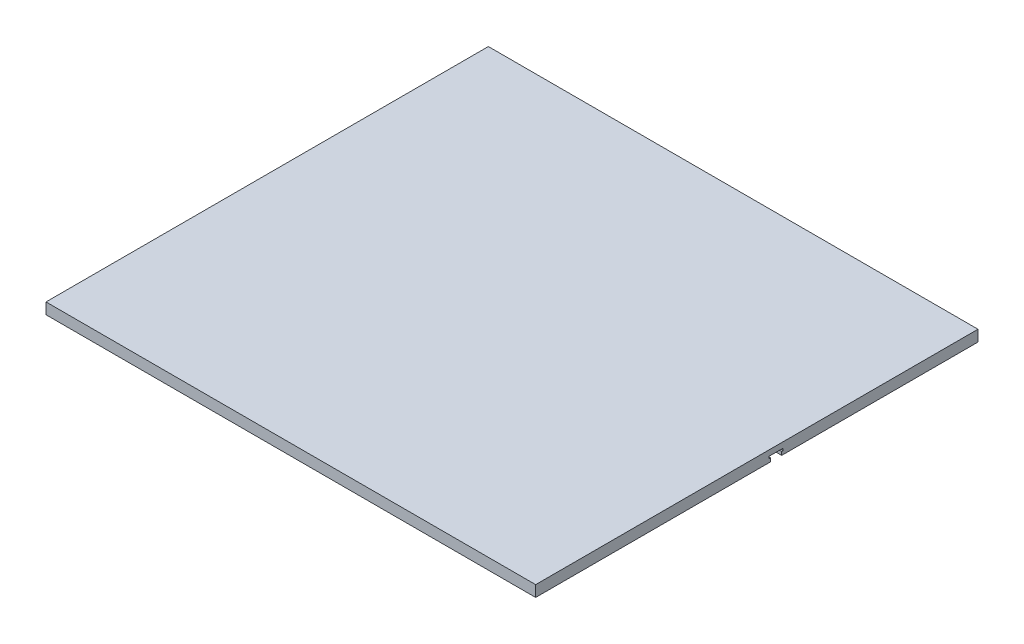
ISO-10303-21;
HEADER;
FILE_DESCRIPTION(('STEP AP214'),'2;1');
FILE_NAME('part.step','',(''),(''),'','','');
FILE_SCHEMA(('AUTOMOTIVE_DESIGN { 1 0 10303 214 1 1 1 1 }'));
ENDSEC;
DATA;
#1=APPLICATION_CONTEXT('core data for automotive mechanical design processes');
#2=APPLICATION_PROTOCOL_DEFINITION('international standard','automotive_design',2000,#1);
#3=PRODUCT_CONTEXT('',#1,'mechanical');
#4=PRODUCT('Part','Part','',(#3));
#5=PRODUCT_RELATED_PRODUCT_CATEGORY('part','',(#4));
#6=PRODUCT_DEFINITION_FORMATION('','',#4);
#7=PRODUCT_DEFINITION_CONTEXT('part definition',#1,'design');
#8=PRODUCT_DEFINITION('design','',#6,#7);
#9=PRODUCT_DEFINITION_SHAPE('','',#8);
#10=(LENGTH_UNIT() NAMED_UNIT(*) SI_UNIT(.MILLI.,.METRE.));
#11=(NAMED_UNIT(*) PLANE_ANGLE_UNIT() SI_UNIT($,.RADIAN.));
#12=(NAMED_UNIT(*) SI_UNIT($,.STERADIAN.) SOLID_ANGLE_UNIT());
#13=UNCERTAINTY_MEASURE_WITH_UNIT(LENGTH_MEASURE(1.E-05),#10,'distance_accuracy_value','');
#14=(GEOMETRIC_REPRESENTATION_CONTEXT(3) GLOBAL_UNCERTAINTY_ASSIGNED_CONTEXT((#13)) GLOBAL_UNIT_ASSIGNED_CONTEXT((#10,
#11,#12)) REPRESENTATION_CONTEXT('',''));
#15=CARTESIAN_POINT('',(0.,0.,0.));
#16=DIRECTION('',(0.,0.,1.));
#17=DIRECTION('',(1.,0.,0.));
#18=AXIS2_PLACEMENT_3D('',#15,#16,#17);
#19=CARTESIAN_POINT('',(0.,0.,0.));
#20=DIRECTION('',(0.,-1.,0.));
#21=DIRECTION('',(0.,0.,-1.));
#22=AXIS2_PLACEMENT_3D('',#19,#20,#21);
#23=PLANE('',#22);
#24=DIRECTION('',(1.,0.,0.));
#25=VECTOR('',#24,1.);
#26=CARTESIAN_POINT('',(0.,0.,-421.176450000013));
#27=LINE('',#26,#25);
#28=CARTESIAN_POINT('',(0.,0.,-421.176450000013));
#29=VERTEX_POINT('',#28);
#30=CARTESIAN_POINT('',(838.2,0.,-421.176450000013));
#31=VERTEX_POINT('',#30);
#32=EDGE_CURVE('E204',#29,#31,#27,.T.);
#33=ORIENTED_EDGE('',*,*,#32,.F.);
#34=DIRECTION('',(0.,0.,1.));
#35=VECTOR('',#34,1.);
#36=CARTESIAN_POINT('',(0.,0.,0.));
#37=LINE('',#36,#35);
#38=CARTESIAN_POINT('',(0.,0.,-757.2375));
#39=VERTEX_POINT('',#38);
#40=EDGE_CURVE('E214',#39,#29,#37,.T.);
#41=ORIENTED_EDGE('',*,*,#40,.F.);
#42=DIRECTION('',(-1.,0.,0.));
#43=VECTOR('',#42,1.);
#44=CARTESIAN_POINT('',(0.,0.,-757.2375));
#45=LINE('',#44,#43);
#46=CARTESIAN_POINT('',(838.2,0.,-757.2375));
#47=VERTEX_POINT('',#46);
#48=EDGE_CURVE('E89',#47,#39,#45,.T.);
#49=ORIENTED_EDGE('',*,*,#48,.F.);
#50=DIRECTION('',(0.,0.,-1.));
#51=VECTOR('',#50,1.);
#52=CARTESIAN_POINT('',(838.2,0.,0.));
#53=LINE('',#52,#51);
#54=EDGE_CURVE('E218',#31,#47,#53,.T.);
#55=ORIENTED_EDGE('',*,*,#54,.F.);
#56=EDGE_LOOP('',(#33,#41,#49,#55));
#57=FACE_BOUND('',#56,.T.);
#58=ADVANCED_FACE('F44',(#57),#23,.T.);
#59=CARTESIAN_POINT('',(0.,19.05,0.));
#60=DIRECTION('',(1.,0.,0.));
#61=DIRECTION('',(0.,0.,-1.));
#62=AXIS2_PLACEMENT_3D('',#59,#60,#61);
#63=PLANE('',#62);
#64=ORIENTED_EDGE('',*,*,#40,.T.);
#65=DIRECTION('',(0.,1.,0.));
#66=VECTOR('',#65,1.);
#67=CARTESIAN_POINT('',(0.,0.,-421.176450000013));
#68=LINE('',#67,#66);
#69=CARTESIAN_POINT('',(0.,5.96265000000044,-421.176450000013));
#70=VERTEX_POINT('',#69);
#71=EDGE_CURVE('E158',#29,#70,#68,.T.);
#72=ORIENTED_EDGE('',*,*,#71,.T.);
#73=DIRECTION('',(0.,0.,-1.));
#74=VECTOR('',#73,1.);
#75=CARTESIAN_POINT('',(0.,5.96265000000044,-421.176450000013));
#76=LINE('',#75,#74);
#77=CARTESIAN_POINT('',(0.,5.96265000000044,-423.843450000013));
#78=VERTEX_POINT('',#77);
#79=EDGE_CURVE('E171',#70,#78,#76,.T.);
#80=ORIENTED_EDGE('',*,*,#79,.T.);
#81=DIRECTION('',(0.,1.,0.));
#82=VECTOR('',#81,1.);
#83=CARTESIAN_POINT('',(0.,5.96265000000044,-423.843450000013));
#84=LINE('',#83,#82);
#85=CARTESIAN_POINT('',(0.,9.51865000000044,-423.843450000013));
#86=VERTEX_POINT('',#85);
#87=EDGE_CURVE('E174',#78,#86,#84,.T.);
#88=ORIENTED_EDGE('',*,*,#87,.T.);
#89=DIRECTION('',(0.,0.,1.));
#90=VECTOR('',#89,1.);
#91=CARTESIAN_POINT('',(0.,9.51865000000044,-423.843450000013));
#92=LINE('',#91,#90);
#93=CARTESIAN_POINT('',(0.,9.51865000000044,-399.459450000013));
#94=VERTEX_POINT('',#93);
#95=EDGE_CURVE('E177',#86,#94,#92,.T.);
#96=ORIENTED_EDGE('',*,*,#95,.T.);
#97=DIRECTION('',(0.,-1.,0.));
#98=VECTOR('',#97,1.);
#99=CARTESIAN_POINT('',(0.,9.51865000000044,-399.459450000013));
#100=LINE('',#99,#98);
#101=CARTESIAN_POINT('',(0.,5.96265000000041,-399.459450000013));
#102=VERTEX_POINT('',#101);
#103=EDGE_CURVE('E151',#94,#102,#100,.T.);
#104=ORIENTED_EDGE('',*,*,#103,.T.);
#105=DIRECTION('',(0.,0.,-1.));
#106=VECTOR('',#105,1.);
#107=CARTESIAN_POINT('',(0.,5.96265000000041,-399.459450000013));
#108=LINE('',#107,#106);
#109=CARTESIAN_POINT('',(0.,5.96265000000041,-402.126450000013));
#110=VERTEX_POINT('',#109);
#111=EDGE_CURVE('E146',#102,#110,#108,.T.);
#112=ORIENTED_EDGE('',*,*,#111,.T.);
#113=DIRECTION('',(0.,-1.,0.));
#114=VECTOR('',#113,1.);
#115=CARTESIAN_POINT('',(0.,5.96265000000041,-402.126450000013));
#116=LINE('',#115,#114);
#117=CARTESIAN_POINT('',(0.,0.,-402.126450000013));
#118=VERTEX_POINT('',#117);
#119=EDGE_CURVE('E154',#110,#118,#116,.T.);
#120=ORIENTED_EDGE('',*,*,#119,.T.);
#121=CARTESIAN_POINT('',(0.,0.,0.));
#122=VERTEX_POINT('',#121);
#123=EDGE_CURVE('E195',#118,#122,#37,.T.);
#124=ORIENTED_EDGE('',*,*,#123,.T.);
#125=DIRECTION('',(0.,-1.,0.));
#126=VECTOR('',#125,1.);
#127=CARTESIAN_POINT('',(0.,19.05,0.));
#128=LINE('',#127,#126);
#129=CARTESIAN_POINT('',(0.,19.05,0.));
#130=VERTEX_POINT('',#129);
#131=EDGE_CURVE('E11',#130,#122,#128,.T.);
#132=ORIENTED_EDGE('',*,*,#131,.F.);
#133=DIRECTION('',(0.,0.,1.));
#134=VECTOR('',#133,1.);
#135=CARTESIAN_POINT('',(0.,19.05,0.));
#136=LINE('',#135,#134);
#137=CARTESIAN_POINT('',(0.,19.05,-757.2375));
#138=VERTEX_POINT('',#137);
#139=EDGE_CURVE('E207',#138,#130,#136,.T.);
#140=ORIENTED_EDGE('',*,*,#139,.F.);
#141=DIRECTION('',(0.,-1.,0.));
#142=VECTOR('',#141,1.);
#143=CARTESIAN_POINT('',(0.,19.05,-757.2375));
#144=LINE('',#143,#142);
#145=EDGE_CURVE('E213',#138,#39,#144,.T.);
#146=ORIENTED_EDGE('',*,*,#145,.T.);
#147=EDGE_LOOP('',(#64,#72,#80,#88,#96,#104,#112,#120,#124,#132,#140,#146));
#148=FACE_BOUND('',#147,.T.);
#149=ADVANCED_FACE('F46',(#148),#63,.F.);
#150=CARTESIAN_POINT('',(0.,19.05,0.));
#151=DIRECTION('',(0.,0.,-1.));
#152=DIRECTION('',(-1.,0.,0.));
#153=AXIS2_PLACEMENT_3D('',#150,#151,#152);
#154=PLANE('',#153);
#155=DIRECTION('',(1.,0.,0.));
#156=VECTOR('',#155,1.);
#157=CARTESIAN_POINT('',(0.,0.,0.));
#158=LINE('',#157,#156);
#159=CARTESIAN_POINT('',(838.2,0.,0.));
#160=VERTEX_POINT('',#159);
#161=EDGE_CURVE('E216',#122,#160,#158,.T.);
#162=ORIENTED_EDGE('',*,*,#161,.T.);
#163=DIRECTION('',(0.,-1.,0.));
#164=VECTOR('',#163,1.);
#165=CARTESIAN_POINT('',(838.2,19.05,0.));
#166=LINE('',#165,#164);
#167=CARTESIAN_POINT('',(838.2,19.05,0.));
#168=VERTEX_POINT('',#167);
#169=EDGE_CURVE('E52',#168,#160,#166,.T.);
#170=ORIENTED_EDGE('',*,*,#169,.F.);
#171=DIRECTION('',(1.,0.,0.));
#172=VECTOR('',#171,1.);
#173=CARTESIAN_POINT('',(0.,19.05,0.));
#174=LINE('',#173,#172);
#175=EDGE_CURVE('E96',#130,#168,#174,.T.);
#176=ORIENTED_EDGE('',*,*,#175,.F.);
#177=ORIENTED_EDGE('',*,*,#131,.T.);
#178=EDGE_LOOP('',(#162,#170,#176,#177));
#179=FACE_BOUND('',#178,.T.);
#180=ADVANCED_FACE('F237',(#179),#154,.F.);
#181=CARTESIAN_POINT('',(838.2,19.05,0.));
#182=DIRECTION('',(-1.,0.,0.));
#183=DIRECTION('',(0.,0.,1.));
#184=AXIS2_PLACEMENT_3D('',#181,#182,#183);
#185=PLANE('',#184);
#186=DIRECTION('',(0.,0.,-1.));
#187=VECTOR('',#186,1.);
#188=CARTESIAN_POINT('',(838.2,5.96265000000044,-421.176450000013));
#189=LINE('',#188,#187);
#190=CARTESIAN_POINT('',(838.2,5.96265000000044,-421.176450000013));
#191=VERTEX_POINT('',#190);
#192=CARTESIAN_POINT('',(838.2,5.96265000000044,-423.843450000013));
#193=VERTEX_POINT('',#192);
#194=EDGE_CURVE('E185',#191,#193,#189,.T.);
#195=ORIENTED_EDGE('',*,*,#194,.F.);
#196=DIRECTION('',(0.,1.,0.));
#197=VECTOR('',#196,1.);
#198=CARTESIAN_POINT('',(838.2,0.,-421.176450000013));
#199=LINE('',#198,#197);
#200=EDGE_CURVE('E182',#31,#191,#199,.T.);
#201=ORIENTED_EDGE('',*,*,#200,.F.);
#202=ORIENTED_EDGE('',*,*,#54,.T.);
#203=DIRECTION('',(0.,-1.,0.));
#204=VECTOR('',#203,1.);
#205=CARTESIAN_POINT('',(838.2,19.05,-757.2375));
#206=LINE('',#205,#204);
#207=CARTESIAN_POINT('',(838.2,19.05,-757.2375));
#208=VERTEX_POINT('',#207);
#209=EDGE_CURVE('E224',#208,#47,#206,.T.);
#210=ORIENTED_EDGE('',*,*,#209,.F.);
#211=DIRECTION('',(0.,0.,-1.));
#212=VECTOR('',#211,1.);
#213=CARTESIAN_POINT('',(838.2,19.05,0.));
#214=LINE('',#213,#212);
#215=EDGE_CURVE('E210',#168,#208,#214,.T.);
#216=ORIENTED_EDGE('',*,*,#215,.F.);
#217=ORIENTED_EDGE('',*,*,#169,.T.);
#218=CARTESIAN_POINT('',(838.2,0.,-402.126450000013));
#219=VERTEX_POINT('',#218);
#220=EDGE_CURVE('E219',#160,#219,#53,.T.);
#221=ORIENTED_EDGE('',*,*,#220,.T.);
#222=DIRECTION('',(0.,-1.,0.));
#223=VECTOR('',#222,1.);
#224=CARTESIAN_POINT('',(838.2,5.96265000000041,-402.126450000013));
#225=LINE('',#224,#223);
#226=CARTESIAN_POINT('',(838.2,5.96265000000041,-402.126450000013));
#227=VERTEX_POINT('',#226);
#228=EDGE_CURVE('E59',#227,#219,#225,.T.);
#229=ORIENTED_EDGE('',*,*,#228,.F.);
#230=DIRECTION('',(0.,0.,-1.));
#231=VECTOR('',#230,1.);
#232=CARTESIAN_POINT('',(838.2,5.96265000000041,-399.459450000013));
#233=LINE('',#232,#231);
#234=CARTESIAN_POINT('',(838.2,5.96265000000041,-399.459450000013));
#235=VERTEX_POINT('',#234);
#236=EDGE_CURVE('E149',#235,#227,#233,.T.);
#237=ORIENTED_EDGE('',*,*,#236,.F.);
#238=DIRECTION('',(0.,-1.,0.));
#239=VECTOR('',#238,1.);
#240=CARTESIAN_POINT('',(838.2,9.51865000000044,-399.459450000013));
#241=LINE('',#240,#239);
#242=CARTESIAN_POINT('',(838.2,9.51865000000044,-399.459450000013));
#243=VERTEX_POINT('',#242);
#244=EDGE_CURVE('E163',#243,#235,#241,.T.);
#245=ORIENTED_EDGE('',*,*,#244,.F.);
#246=DIRECTION('',(0.,0.,1.));
#247=VECTOR('',#246,1.);
#248=CARTESIAN_POINT('',(838.2,9.51865000000044,-423.843450000013));
#249=LINE('',#248,#247);
#250=CARTESIAN_POINT('',(838.2,9.51865000000044,-423.843450000013));
#251=VERTEX_POINT('',#250);
#252=EDGE_CURVE('E166',#251,#243,#249,.T.);
#253=ORIENTED_EDGE('',*,*,#252,.F.);
#254=DIRECTION('',(0.,1.,0.));
#255=VECTOR('',#254,1.);
#256=CARTESIAN_POINT('',(838.2,5.96265000000044,-423.843450000013));
#257=LINE('',#256,#255);
#258=EDGE_CURVE('E188',#193,#251,#257,.T.);
#259=ORIENTED_EDGE('',*,*,#258,.F.);
#260=EDGE_LOOP('',(#195,#201,#202,#210,#216,#217,#221,#229,#237,#245,#253,#259));
#261=FACE_BOUND('',#260,.T.);
#262=ADVANCED_FACE('F230',(#261),#185,.F.);
#263=CARTESIAN_POINT('',(0.,19.05,-757.2375));
#264=DIRECTION('',(0.,0.,1.));
#265=DIRECTION('',(1.,0.,0.));
#266=AXIS2_PLACEMENT_3D('',#263,#264,#265);
#267=PLANE('',#266);
#268=ORIENTED_EDGE('',*,*,#48,.T.);
#269=ORIENTED_EDGE('',*,*,#145,.F.);
#270=DIRECTION('',(-1.,0.,0.));
#271=VECTOR('',#270,1.);
#272=CARTESIAN_POINT('',(0.,19.05,-757.2375));
#273=LINE('',#272,#271);
#274=EDGE_CURVE('E68',#208,#138,#273,.T.);
#275=ORIENTED_EDGE('',*,*,#274,.F.);
#276=ORIENTED_EDGE('',*,*,#209,.T.);
#277=EDGE_LOOP('',(#268,#269,#275,#276));
#278=FACE_BOUND('',#277,.T.);
#279=ADVANCED_FACE('F243',(#278),#267,.F.);
#280=CARTESIAN_POINT('',(0.,19.05,0.));
#281=DIRECTION('',(0.,-1.,0.));
#282=DIRECTION('',(0.,0.,-1.));
#283=AXIS2_PLACEMENT_3D('',#280,#281,#282);
#284=PLANE('',#283);
#285=ORIENTED_EDGE('',*,*,#139,.T.);
#286=ORIENTED_EDGE('',*,*,#175,.T.);
#287=ORIENTED_EDGE('',*,*,#215,.T.);
#288=ORIENTED_EDGE('',*,*,#274,.T.);
#289=EDGE_LOOP('',(#285,#286,#287,#288));
#290=FACE_BOUND('',#289,.T.);
#291=ADVANCED_FACE('F257',(#290),#284,.F.);
#292=DIRECTION('',(1.,0.,0.));
#293=VECTOR('',#292,1.);
#294=CARTESIAN_POINT('',(0.,0.,-402.126450000013));
#295=LINE('',#294,#293);
#296=EDGE_CURVE('E150',#118,#219,#295,.T.);
#297=ORIENTED_EDGE('',*,*,#296,.T.);
#298=ORIENTED_EDGE('',*,*,#220,.F.);
#299=ORIENTED_EDGE('',*,*,#161,.F.);
#300=ORIENTED_EDGE('',*,*,#123,.F.);
#301=EDGE_LOOP('',(#297,#298,#299,#300));
#302=FACE_BOUND('',#301,.T.);
#303=ADVANCED_FACE('F234',(#302),#23,.T.);
#304=CARTESIAN_POINT('',(0.,5.96265000000041,-399.459450000013));
#305=DIRECTION('',(0.,-1.,0.));
#306=DIRECTION('',(0.,0.,-1.));
#307=AXIS2_PLACEMENT_3D('',#304,#305,#306);
#308=PLANE('',#307);
#309=ORIENTED_EDGE('',*,*,#236,.T.);
#310=DIRECTION('',(1.,0.,0.));
#311=VECTOR('',#310,1.);
#312=CARTESIAN_POINT('',(0.,5.96265000000041,-402.126450000013));
#313=LINE('',#312,#311);
#314=EDGE_CURVE('E142',#110,#227,#313,.T.);
#315=ORIENTED_EDGE('',*,*,#314,.F.);
#316=ORIENTED_EDGE('',*,*,#111,.F.);
#317=DIRECTION('',(1.,0.,0.));
#318=VECTOR('',#317,1.);
#319=CARTESIAN_POINT('',(0.,5.96265000000041,-399.459450000013));
#320=LINE('',#319,#318);
#321=EDGE_CURVE('E193',#102,#235,#320,.T.);
#322=ORIENTED_EDGE('',*,*,#321,.T.);
#323=EDGE_LOOP('',(#309,#315,#316,#322));
#324=FACE_BOUND('',#323,.T.);
#325=ADVANCED_FACE('F144',(#324),#308,.F.);
#326=CARTESIAN_POINT('',(0.,9.51865000000044,-399.459450000013));
#327=DIRECTION('',(0.,0.,1.));
#328=DIRECTION('',(1.,0.,0.));
#329=AXIS2_PLACEMENT_3D('',#326,#327,#328);
#330=PLANE('',#329);
#331=ORIENTED_EDGE('',*,*,#244,.T.);
#332=ORIENTED_EDGE('',*,*,#321,.F.);
#333=ORIENTED_EDGE('',*,*,#103,.F.);
#334=DIRECTION('',(1.,0.,0.));
#335=VECTOR('',#334,1.);
#336=CARTESIAN_POINT('',(0.,9.51865000000044,-399.459450000013));
#337=LINE('',#336,#335);
#338=EDGE_CURVE('E196',#94,#243,#337,.T.);
#339=ORIENTED_EDGE('',*,*,#338,.T.);
#340=EDGE_LOOP('',(#331,#332,#333,#339));
#341=FACE_BOUND('',#340,.T.);
#342=ADVANCED_FACE('F261',(#341),#330,.F.);
#343=CARTESIAN_POINT('',(0.,9.51865000000044,-423.843450000013));
#344=DIRECTION('',(0.,1.,0.));
#345=DIRECTION('',(0.,0.,1.));
#346=AXIS2_PLACEMENT_3D('',#343,#344,#345);
#347=PLANE('',#346);
#348=ORIENTED_EDGE('',*,*,#252,.T.);
#349=ORIENTED_EDGE('',*,*,#338,.F.);
#350=ORIENTED_EDGE('',*,*,#95,.F.);
#351=DIRECTION('',(1.,0.,0.));
#352=VECTOR('',#351,1.);
#353=CARTESIAN_POINT('',(0.,9.51865000000044,-423.843450000013));
#354=LINE('',#353,#352);
#355=EDGE_CURVE('E198',#86,#251,#354,.T.);
#356=ORIENTED_EDGE('',*,*,#355,.T.);
#357=EDGE_LOOP('',(#348,#349,#350,#356));
#358=FACE_BOUND('',#357,.T.);
#359=ADVANCED_FACE('F280',(#358),#347,.F.);
#360=CARTESIAN_POINT('',(0.,5.96265000000044,-423.843450000013));
#361=DIRECTION('',(0.,0.,-1.));
#362=DIRECTION('',(-1.,0.,0.));
#363=AXIS2_PLACEMENT_3D('',#360,#361,#362);
#364=PLANE('',#363);
#365=ORIENTED_EDGE('',*,*,#258,.T.);
#366=ORIENTED_EDGE('',*,*,#355,.F.);
#367=ORIENTED_EDGE('',*,*,#87,.F.);
#368=DIRECTION('',(1.,0.,0.));
#369=VECTOR('',#368,1.);
#370=CARTESIAN_POINT('',(0.,5.96265000000044,-423.843450000013));
#371=LINE('',#370,#369);
#372=EDGE_CURVE('E200',#78,#193,#371,.T.);
#373=ORIENTED_EDGE('',*,*,#372,.T.);
#374=EDGE_LOOP('',(#365,#366,#367,#373));
#375=FACE_BOUND('',#374,.T.);
#376=ADVANCED_FACE('F276',(#375),#364,.F.);
#377=CARTESIAN_POINT('',(0.,5.96265000000044,-421.176450000013));
#378=DIRECTION('',(0.,-1.,0.));
#379=DIRECTION('',(0.,0.,-1.));
#380=AXIS2_PLACEMENT_3D('',#377,#378,#379);
#381=PLANE('',#380);
#382=ORIENTED_EDGE('',*,*,#194,.T.);
#383=ORIENTED_EDGE('',*,*,#372,.F.);
#384=ORIENTED_EDGE('',*,*,#79,.F.);
#385=DIRECTION('',(1.,0.,0.));
#386=VECTOR('',#385,1.);
#387=CARTESIAN_POINT('',(0.,5.96265000000044,-421.176450000013));
#388=LINE('',#387,#386);
#389=EDGE_CURVE('E202',#70,#191,#388,.T.);
#390=ORIENTED_EDGE('',*,*,#389,.T.);
#391=EDGE_LOOP('',(#382,#383,#384,#390));
#392=FACE_BOUND('',#391,.T.);
#393=ADVANCED_FACE('F272',(#392),#381,.F.);
#394=CARTESIAN_POINT('',(0.,0.,-421.176450000013));
#395=DIRECTION('',(0.,0.,-1.));
#396=DIRECTION('',(0.,1.,0.));
#397=AXIS2_PLACEMENT_3D('',#394,#395,#396);
#398=PLANE('',#397);
#399=ORIENTED_EDGE('',*,*,#200,.T.);
#400=ORIENTED_EDGE('',*,*,#389,.F.);
#401=ORIENTED_EDGE('',*,*,#71,.F.);
#402=ORIENTED_EDGE('',*,*,#32,.T.);
#403=EDGE_LOOP('',(#399,#400,#401,#402));
#404=FACE_BOUND('',#403,.T.);
#405=ADVANCED_FACE('F269',(#404),#398,.F.);
#406=CARTESIAN_POINT('',(0.,5.96265000000041,-402.126450000013));
#407=DIRECTION('',(0.,0.,1.));
#408=DIRECTION('',(0.,-1.,0.));
#409=AXIS2_PLACEMENT_3D('',#406,#407,#408);
#410=PLANE('',#409);
#411=ORIENTED_EDGE('',*,*,#228,.T.);
#412=ORIENTED_EDGE('',*,*,#296,.F.);
#413=ORIENTED_EDGE('',*,*,#119,.F.);
#414=ORIENTED_EDGE('',*,*,#314,.T.);
#415=EDGE_LOOP('',(#411,#412,#413,#414));
#416=FACE_BOUND('',#415,.T.);
#417=ADVANCED_FACE('F155',(#416),#410,.F.);
#418=CLOSED_SHELL('',(#58,#149,#180,#262,#279,#291,#303,#325,#342,#359,#376,#393,#405,#417));
#419=MANIFOLD_SOLID_BREP('B2',#418);
#420=ADVANCED_BREP_SHAPE_REPRESENTATION('',(#18,#419),#14);
#421=SHAPE_DEFINITION_REPRESENTATION(#9,#420);
ENDSEC;
END-ISO-10303-21;
